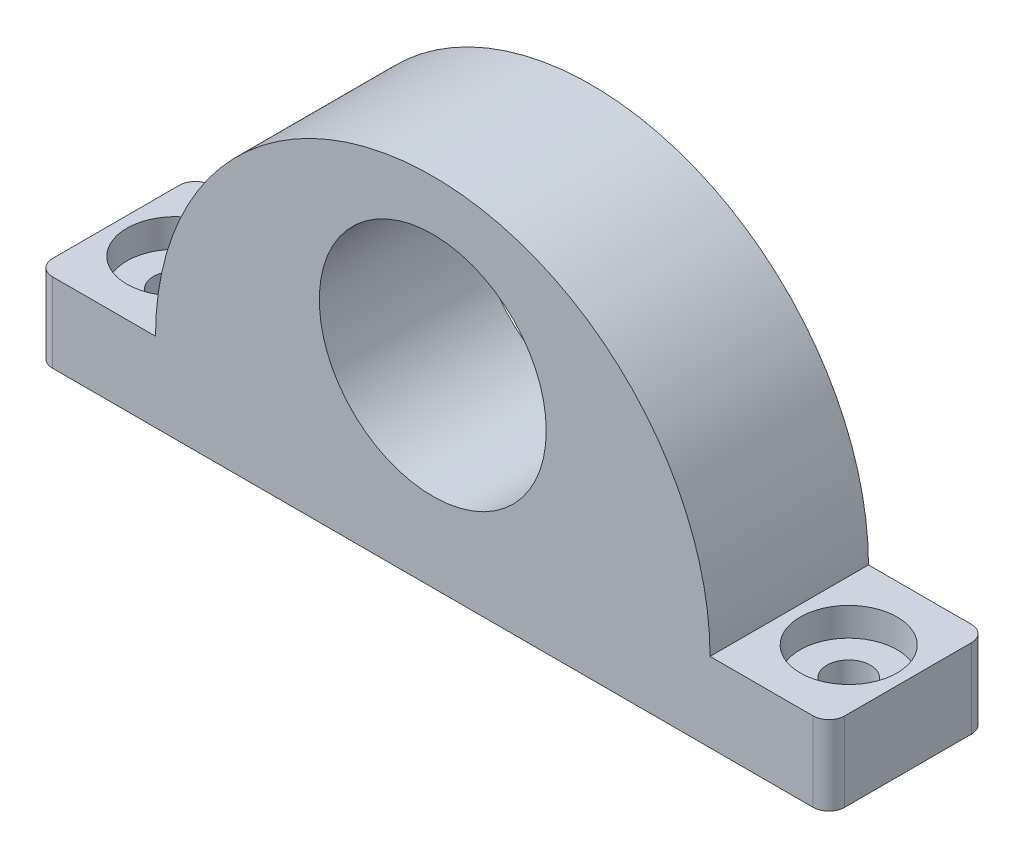
ISO-10303-21;
HEADER;
FILE_DESCRIPTION(('STEP AP214'),'2;1');
FILE_NAME('part.step','',(''),(''),'','','');
FILE_SCHEMA(('AUTOMOTIVE_DESIGN { 1 0 10303 214 1 1 1 1 }'));
ENDSEC;
DATA;
#1=APPLICATION_CONTEXT('core data for automotive mechanical design processes');
#2=APPLICATION_PROTOCOL_DEFINITION('international standard','automotive_design',2000,#1);
#3=PRODUCT_CONTEXT('',#1,'mechanical');
#4=PRODUCT('Part','Part','',(#3));
#5=PRODUCT_RELATED_PRODUCT_CATEGORY('part','',(#4));
#6=PRODUCT_DEFINITION_FORMATION('','',#4);
#7=PRODUCT_DEFINITION_CONTEXT('part definition',#1,'design');
#8=PRODUCT_DEFINITION('design','',#6,#7);
#9=PRODUCT_DEFINITION_SHAPE('','',#8);
#10=(LENGTH_UNIT() NAMED_UNIT(*) SI_UNIT(.MILLI.,.METRE.));
#11=(NAMED_UNIT(*) PLANE_ANGLE_UNIT() SI_UNIT($,.RADIAN.));
#12=(NAMED_UNIT(*) SI_UNIT($,.STERADIAN.) SOLID_ANGLE_UNIT());
#13=UNCERTAINTY_MEASURE_WITH_UNIT(LENGTH_MEASURE(1.E-05),#10,'distance_accuracy_value','');
#14=(GEOMETRIC_REPRESENTATION_CONTEXT(3) GLOBAL_UNCERTAINTY_ASSIGNED_CONTEXT((#13)) GLOBAL_UNIT_ASSIGNED_CONTEXT((#10,
#11,#12)) REPRESENTATION_CONTEXT('',''));
#15=CARTESIAN_POINT('',(0.,0.,0.));
#16=DIRECTION('',(0.,0.,1.));
#17=DIRECTION('',(1.,0.,0.));
#18=AXIS2_PLACEMENT_3D('',#15,#16,#17);
#19=CARTESIAN_POINT('',(-50.,0.,20.));
#20=DIRECTION('',(-1.,0.,0.));
#21=DIRECTION('',(0.,0.,1.));
#22=AXIS2_PLACEMENT_3D('',#19,#20,#21);
#23=PLANE('',#22);
#24=DIRECTION('',(0.,0.,-1.));
#25=VECTOR('',#24,1.);
#26=CARTESIAN_POINT('',(-50.,5.,20.));
#27=LINE('',#26,#25);
#28=CARTESIAN_POINT('',(-50.,5.,18.));
#29=VERTEX_POINT('',#28);
#30=CARTESIAN_POINT('',(-50.,5.,2.));
#31=VERTEX_POINT('',#30);
#32=EDGE_CURVE('E148',#29,#31,#27,.T.);
#33=ORIENTED_EDGE('',*,*,#32,.T.);
#34=DIRECTION('',(0.,1.,0.));
#35=VECTOR('',#34,1.);
#36=CARTESIAN_POINT('',(-50.,-5.,2.));
#37=LINE('',#36,#35);
#38=CARTESIAN_POINT('',(-50.,-5.,2.));
#39=VERTEX_POINT('',#38);
#40=EDGE_CURVE('E183',#31,#39,#37,.F.);
#41=ORIENTED_EDGE('',*,*,#40,.T.);
#42=DIRECTION('',(0.,0.,-1.));
#43=VECTOR('',#42,1.);
#44=CARTESIAN_POINT('',(-50.,-5.,20.));
#45=LINE('',#44,#43);
#46=CARTESIAN_POINT('',(-50.,-5.,18.));
#47=VERTEX_POINT('',#46);
#48=EDGE_CURVE('E168',#47,#39,#45,.T.);
#49=ORIENTED_EDGE('',*,*,#48,.F.);
#50=DIRECTION('',(0.,1.,0.));
#51=VECTOR('',#50,1.);
#52=CARTESIAN_POINT('',(-50.,0.,18.));
#53=LINE('',#52,#51);
#54=EDGE_CURVE('E180',#47,#29,#53,.T.);
#55=ORIENTED_EDGE('',*,*,#54,.T.);
#56=EDGE_LOOP('',(#33,#41,#49,#55));
#57=FACE_BOUND('',#56,.T.);
#58=ADVANCED_FACE('F34',(#57),#23,.T.);
#59=CARTESIAN_POINT('',(0.,-5.,20.));
#60=DIRECTION('',(0.,-1.,0.));
#61=DIRECTION('',(1.,0.,0.));
#62=AXIS2_PLACEMENT_3D('',#59,#60,#61);
#63=PLANE('',#62);
#64=CARTESIAN_POINT('',(-42.5,-5.,10.));
#65=DIRECTION('',(0.,-1.,0.));
#66=DIRECTION('',(1.,0.,0.));
#67=AXIS2_PLACEMENT_3D('',#64,#65,#66);
#68=CIRCLE('',#67,2.75);
#69=CARTESIAN_POINT('',(-39.75,-5.,10.));
#70=VERTEX_POINT('',#69);
#71=EDGE_CURVE('E419',#70,#70,#68,.T.);
#72=ORIENTED_EDGE('',*,*,#71,.F.);
#73=EDGE_LOOP('',(#72));
#74=FACE_BOUND('',#73,.T.);
#75=CARTESIAN_POINT('',(42.5,-4.99999999999999,10.));
#76=DIRECTION('',(0.,-1.,0.));
#77=DIRECTION('',(1.,0.,0.));
#78=AXIS2_PLACEMENT_3D('',#75,#76,#77);
#79=CIRCLE('',#78,2.75);
#80=CARTESIAN_POINT('',(45.25,-4.99999999999999,10.));
#81=VERTEX_POINT('',#80);
#82=EDGE_CURVE('E152',#81,#81,#79,.T.);
#83=ORIENTED_EDGE('',*,*,#82,.F.);
#84=EDGE_LOOP('',(#83));
#85=FACE_BOUND('',#84,.T.);
#86=ORIENTED_EDGE('',*,*,#48,.T.);
#87=CARTESIAN_POINT('',(-48.,-5.,2.));
#88=DIRECTION('',(0.,-1.,0.));
#89=DIRECTION('',(1.,0.,0.));
#90=AXIS2_PLACEMENT_3D('',#87,#88,#89);
#91=CIRCLE('',#90,2.);
#92=CARTESIAN_POINT('',(-48.,-5.,0.));
#93=VERTEX_POINT('',#92);
#94=EDGE_CURVE('E191',#39,#93,#91,.T.);
#95=ORIENTED_EDGE('',*,*,#94,.T.);
#96=DIRECTION('',(-1.,0.,0.));
#97=VECTOR('',#96,1.);
#98=CARTESIAN_POINT('',(0.,-5.,0.));
#99=LINE('',#98,#97);
#100=CARTESIAN_POINT('',(48.,-4.99999999999999,0.));
#101=VERTEX_POINT('',#100);
#102=EDGE_CURVE('E149',#101,#93,#99,.T.);
#103=ORIENTED_EDGE('',*,*,#102,.F.);
#104=CARTESIAN_POINT('',(48.,-4.99999999999999,2.));
#105=DIRECTION('',(0.,-1.,0.));
#106=DIRECTION('',(1.,0.,0.));
#107=AXIS2_PLACEMENT_3D('',#104,#105,#106);
#108=CIRCLE('',#107,2.);
#109=CARTESIAN_POINT('',(50.,-4.99999999999997,2.));
#110=VERTEX_POINT('',#109);
#111=EDGE_CURVE('E189',#101,#110,#108,.T.);
#112=ORIENTED_EDGE('',*,*,#111,.T.);
#113=DIRECTION('',(0.,0.,-1.));
#114=VECTOR('',#113,1.);
#115=CARTESIAN_POINT('',(50.,-4.99999999999997,20.));
#116=LINE('',#115,#114);
#117=CARTESIAN_POINT('',(50.,-4.99999999999997,18.));
#118=VERTEX_POINT('',#117);
#119=EDGE_CURVE('E165',#118,#110,#116,.T.);
#120=ORIENTED_EDGE('',*,*,#119,.F.);
#121=CARTESIAN_POINT('',(48.,-4.99999999999999,18.));
#122=DIRECTION('',(0.,-1.,0.));
#123=DIRECTION('',(1.,0.,0.));
#124=AXIS2_PLACEMENT_3D('',#121,#122,#123);
#125=CIRCLE('',#124,2.);
#126=CARTESIAN_POINT('',(48.,-4.99999999999999,20.));
#127=VERTEX_POINT('',#126);
#128=EDGE_CURVE('E187',#118,#127,#125,.T.);
#129=ORIENTED_EDGE('',*,*,#128,.T.);
#130=DIRECTION('',(-1.,0.,0.));
#131=VECTOR('',#130,1.);
#132=CARTESIAN_POINT('',(0.,-5.,20.));
#133=LINE('',#132,#131);
#134=CARTESIAN_POINT('',(-48.,-5.,20.));
#135=VERTEX_POINT('',#134);
#136=EDGE_CURVE('E137',#127,#135,#133,.T.);
#137=ORIENTED_EDGE('',*,*,#136,.T.);
#138=CARTESIAN_POINT('',(-48.,-5.,18.));
#139=DIRECTION('',(0.,-1.,0.));
#140=DIRECTION('',(1.,0.,0.));
#141=AXIS2_PLACEMENT_3D('',#138,#139,#140);
#142=CIRCLE('',#141,2.);
#143=EDGE_CURVE('E185',#135,#47,#142,.T.);
#144=ORIENTED_EDGE('',*,*,#143,.T.);
#145=EDGE_LOOP('',(#86,#95,#103,#112,#120,#129,#137,#144));
#146=FACE_BOUND('',#145,.T.);
#147=ADVANCED_FACE('F202',(#74,#85,#146),#63,.T.);
#148=CARTESIAN_POINT('',(50.,0.,20.));
#149=DIRECTION('',(-1.,0.,0.));
#150=DIRECTION('',(0.,0.,1.));
#151=AXIS2_PLACEMENT_3D('',#148,#149,#150);
#152=PLANE('',#151);
#153=ORIENTED_EDGE('',*,*,#119,.T.);
#154=DIRECTION('',(0.,1.,0.));
#155=VECTOR('',#154,1.);
#156=CARTESIAN_POINT('',(50.,0.,2.));
#157=LINE('',#156,#155);
#158=CARTESIAN_POINT('',(50.,5.00000000000003,2.));
#159=VERTEX_POINT('',#158);
#160=EDGE_CURVE('E195',#110,#159,#157,.T.);
#161=ORIENTED_EDGE('',*,*,#160,.T.);
#162=DIRECTION('',(0.,0.,-1.));
#163=VECTOR('',#162,1.);
#164=CARTESIAN_POINT('',(50.,5.00000000000003,20.));
#165=LINE('',#164,#163);
#166=CARTESIAN_POINT('',(50.,5.00000000000003,18.));
#167=VERTEX_POINT('',#166);
#168=EDGE_CURVE('E122',#167,#159,#165,.T.);
#169=ORIENTED_EDGE('',*,*,#168,.F.);
#170=DIRECTION('',(0.,1.,0.));
#171=VECTOR('',#170,1.);
#172=CARTESIAN_POINT('',(50.,-4.99999999999997,18.));
#173=LINE('',#172,#171);
#174=EDGE_CURVE('E193',#167,#118,#173,.F.);
#175=ORIENTED_EDGE('',*,*,#174,.T.);
#176=EDGE_LOOP('',(#153,#161,#169,#175));
#177=FACE_BOUND('',#176,.T.);
#178=ADVANCED_FACE('F225',(#177),#152,.F.);
#179=CARTESIAN_POINT('',(0.,4.99999999999992,20.));
#180=DIRECTION('',(0.,1.,0.));
#181=DIRECTION('',(-1.,0.,0.));
#182=AXIS2_PLACEMENT_3D('',#179,#180,#181);
#183=PLANE('',#182);
#184=CARTESIAN_POINT('',(42.5,5.00000000000001,10.));
#185=DIRECTION('',(0.,1.,0.));
#186=DIRECTION('',(0.,0.,1.));
#187=AXIS2_PLACEMENT_3D('',#184,#185,#186);
#188=CIRCLE('',#187,6.12);
#189=CARTESIAN_POINT('',(42.5,5.00000000000001,16.12));
#190=VERTEX_POINT('',#189);
#191=EDGE_CURVE('E416',#190,#190,#188,.T.);
#192=ORIENTED_EDGE('',*,*,#191,.F.);
#193=EDGE_LOOP('',(#192));
#194=FACE_BOUND('',#193,.T.);
#195=ORIENTED_EDGE('',*,*,#168,.T.);
#196=CARTESIAN_POINT('',(48.,5.00000000000003,2.));
#197=DIRECTION('',(0.,1.,0.));
#198=DIRECTION('',(-1.,0.,0.));
#199=AXIS2_PLACEMENT_3D('',#196,#197,#198);
#200=CIRCLE('',#199,2.);
#201=CARTESIAN_POINT('',(48.,5.00000000000003,0.));
#202=VERTEX_POINT('',#201);
#203=EDGE_CURVE('E56',#159,#202,#200,.T.);
#204=ORIENTED_EDGE('',*,*,#203,.T.);
#205=DIRECTION('',(1.,0.,0.));
#206=VECTOR('',#205,1.);
#207=CARTESIAN_POINT('',(0.,4.99999999999992,0.));
#208=LINE('',#207,#206);
#209=CARTESIAN_POINT('',(35.,5.,0.));
#210=VERTEX_POINT('',#209);
#211=EDGE_CURVE('E119',#210,#202,#208,.T.);
#212=ORIENTED_EDGE('',*,*,#211,.F.);
#213=DIRECTION('',(0.,0.,-1.));
#214=VECTOR('',#213,1.);
#215=CARTESIAN_POINT('',(35.,5.,20.));
#216=LINE('',#215,#214);
#217=CARTESIAN_POINT('',(35.,5.,20.));
#218=VERTEX_POINT('',#217);
#219=EDGE_CURVE('E112',#218,#210,#216,.T.);
#220=ORIENTED_EDGE('',*,*,#219,.F.);
#221=DIRECTION('',(1.,0.,0.));
#222=VECTOR('',#221,1.);
#223=CARTESIAN_POINT('',(0.,4.99999999999992,20.));
#224=LINE('',#223,#222);
#225=CARTESIAN_POINT('',(48.,5.00000000000003,20.));
#226=VERTEX_POINT('',#225);
#227=EDGE_CURVE('E117',#218,#226,#224,.T.);
#228=ORIENTED_EDGE('',*,*,#227,.T.);
#229=CARTESIAN_POINT('',(48.,5.00000000000003,18.));
#230=DIRECTION('',(0.,1.,0.));
#231=DIRECTION('',(-1.,0.,0.));
#232=AXIS2_PLACEMENT_3D('',#229,#230,#231);
#233=CIRCLE('',#232,2.);
#234=EDGE_CURVE('E49',#226,#167,#233,.T.);
#235=ORIENTED_EDGE('',*,*,#234,.T.);
#236=EDGE_LOOP('',(#195,#204,#212,#220,#228,#235));
#237=FACE_BOUND('',#236,.T.);
#238=ADVANCED_FACE('F115',(#194,#237),#183,.T.);
#239=CARTESIAN_POINT('',(0.,5.,20.));
#240=DIRECTION('',(0.,0.,-1.));
#241=DIRECTION('',(-1.,0.,0.));
#242=AXIS2_PLACEMENT_3D('',#239,#240,#241);
#243=CYLINDRICAL_SURFACE('',#242,35.);
#244=CARTESIAN_POINT('',(0.,5.,0.));
#245=DIRECTION('',(0.,0.,1.));
#246=DIRECTION('',(1.,0.,0.));
#247=AXIS2_PLACEMENT_3D('',#244,#245,#246);
#248=CIRCLE('',#247,35.);
#249=CARTESIAN_POINT('',(-35.,5.,0.));
#250=VERTEX_POINT('',#249);
#251=EDGE_CURVE('E154',#210,#250,#248,.T.);
#252=ORIENTED_EDGE('',*,*,#251,.T.);
#253=DIRECTION('',(0.,0.,-1.));
#254=VECTOR('',#253,1.);
#255=CARTESIAN_POINT('',(-35.,5.,20.));
#256=LINE('',#255,#254);
#257=CARTESIAN_POINT('',(-35.,5.,20.));
#258=VERTEX_POINT('',#257);
#259=EDGE_CURVE('E123',#258,#250,#256,.T.);
#260=ORIENTED_EDGE('',*,*,#259,.F.);
#261=CARTESIAN_POINT('',(0.,5.,20.));
#262=DIRECTION('',(0.,0.,1.));
#263=DIRECTION('',(1.,0.,0.));
#264=AXIS2_PLACEMENT_3D('',#261,#262,#263);
#265=CIRCLE('',#264,35.);
#266=EDGE_CURVE('E126',#218,#258,#265,.T.);
#267=ORIENTED_EDGE('',*,*,#266,.F.);
#268=ORIENTED_EDGE('',*,*,#219,.T.);
#269=EDGE_LOOP('',(#252,#260,#267,#268));
#270=FACE_BOUND('',#269,.T.);
#271=ADVANCED_FACE('F127',(#270),#243,.T.);
#272=CARTESIAN_POINT('',(0.,5.,20.));
#273=DIRECTION('',(0.,-1.,0.));
#274=DIRECTION('',(1.,0.,0.));
#275=AXIS2_PLACEMENT_3D('',#272,#273,#274);
#276=PLANE('',#275);
#277=CARTESIAN_POINT('',(-42.5,5.,10.));
#278=DIRECTION('',(0.,1.,0.));
#279=DIRECTION('',(0.,0.,1.));
#280=AXIS2_PLACEMENT_3D('',#277,#278,#279);
#281=CIRCLE('',#280,6.12);
#282=CARTESIAN_POINT('',(-42.5,5.,16.12));
#283=VERTEX_POINT('',#282);
#284=EDGE_CURVE('E442',#283,#283,#281,.T.);
#285=ORIENTED_EDGE('',*,*,#284,.F.);
#286=EDGE_LOOP('',(#285));
#287=FACE_BOUND('',#286,.T.);
#288=DIRECTION('',(-1.,0.,0.));
#289=VECTOR('',#288,1.);
#290=CARTESIAN_POINT('',(0.,5.,0.));
#291=LINE('',#290,#289);
#292=CARTESIAN_POINT('',(-48.,5.,0.));
#293=VERTEX_POINT('',#292);
#294=EDGE_CURVE('E156',#250,#293,#291,.T.);
#295=ORIENTED_EDGE('',*,*,#294,.T.);
#296=CARTESIAN_POINT('',(-48.,5.,2.));
#297=DIRECTION('',(0.,-1.,0.));
#298=DIRECTION('',(1.,0.,0.));
#299=AXIS2_PLACEMENT_3D('',#296,#297,#298);
#300=CIRCLE('',#299,2.);
#301=EDGE_CURVE('E178',#293,#31,#300,.F.);
#302=ORIENTED_EDGE('',*,*,#301,.T.);
#303=ORIENTED_EDGE('',*,*,#32,.F.);
#304=CARTESIAN_POINT('',(-48.,5.,18.));
#305=DIRECTION('',(0.,-1.,0.));
#306=DIRECTION('',(1.,0.,0.));
#307=AXIS2_PLACEMENT_3D('',#304,#305,#306);
#308=CIRCLE('',#307,2.);
#309=CARTESIAN_POINT('',(-48.,5.,20.));
#310=VERTEX_POINT('',#309);
#311=EDGE_CURVE('E176',#29,#310,#308,.F.);
#312=ORIENTED_EDGE('',*,*,#311,.T.);
#313=DIRECTION('',(-1.,0.,0.));
#314=VECTOR('',#313,1.);
#315=CARTESIAN_POINT('',(0.,5.,20.));
#316=LINE('',#315,#314);
#317=EDGE_CURVE('E132',#258,#310,#316,.T.);
#318=ORIENTED_EDGE('',*,*,#317,.F.);
#319=ORIENTED_EDGE('',*,*,#259,.T.);
#320=EDGE_LOOP('',(#295,#302,#303,#312,#318,#319));
#321=FACE_BOUND('',#320,.T.);
#322=ADVANCED_FACE('F211',(#287,#321),#276,.F.);
#323=CARTESIAN_POINT('',(0.,19.325,20.));
#324=DIRECTION('',(0.,0.,-1.));
#325=DIRECTION('',(-1.,0.,0.));
#326=AXIS2_PLACEMENT_3D('',#323,#324,#325);
#327=CYLINDRICAL_SURFACE('',#326,14.325);
#328=CARTESIAN_POINT('',(0.,19.325,20.));
#329=DIRECTION('',(0.,0.,1.));
#330=DIRECTION('',(1.,0.,0.));
#331=AXIS2_PLACEMENT_3D('',#328,#329,#330);
#332=CIRCLE('',#331,14.325);
#333=CARTESIAN_POINT('',(14.325,19.325,20.));
#334=VERTEX_POINT('',#333);
#335=EDGE_CURVE('E145',#334,#334,#332,.T.);
#336=ORIENTED_EDGE('',*,*,#335,.T.);
#337=EDGE_LOOP('',(#336));
#338=FACE_BOUND('',#337,.T.);
#339=CARTESIAN_POINT('',(0.,19.325,0.));
#340=DIRECTION('',(0.,0.,1.));
#341=DIRECTION('',(1.,0.,0.));
#342=AXIS2_PLACEMENT_3D('',#339,#340,#341);
#343=CIRCLE('',#342,14.325);
#344=CARTESIAN_POINT('',(14.325,19.325,0.));
#345=VERTEX_POINT('',#344);
#346=EDGE_CURVE('E140',#345,#345,#343,.T.);
#347=ORIENTED_EDGE('',*,*,#346,.F.);
#348=EDGE_LOOP('',(#347));
#349=FACE_BOUND('',#348,.T.);
#350=ADVANCED_FACE('F276',(#338,#349),#327,.F.);
#351=CARTESIAN_POINT('',(0.,0.,20.));
#352=DIRECTION('',(0.,0.,1.));
#353=DIRECTION('',(1.,0.,0.));
#354=AXIS2_PLACEMENT_3D('',#351,#352,#353);
#355=PLANE('',#354);
#356=ORIENTED_EDGE('',*,*,#136,.F.);
#357=DIRECTION('',(0.,1.,0.));
#358=VECTOR('',#357,1.);
#359=CARTESIAN_POINT('',(48.,5.00000000000003,20.));
#360=LINE('',#359,#358);
#361=EDGE_CURVE('E11',#127,#226,#360,.T.);
#362=ORIENTED_EDGE('',*,*,#361,.T.);
#363=ORIENTED_EDGE('',*,*,#227,.F.);
#364=ORIENTED_EDGE('',*,*,#266,.T.);
#365=ORIENTED_EDGE('',*,*,#317,.T.);
#366=DIRECTION('',(0.,1.,0.));
#367=VECTOR('',#366,1.);
#368=CARTESIAN_POINT('',(-48.,0.,20.));
#369=LINE('',#368,#367);
#370=EDGE_CURVE('E42',#310,#135,#369,.F.);
#371=ORIENTED_EDGE('',*,*,#370,.T.);
#372=EDGE_LOOP('',(#356,#362,#363,#364,#365,#371));
#373=FACE_BOUND('',#372,.T.);
#374=ORIENTED_EDGE('',*,*,#335,.F.);
#375=EDGE_LOOP('',(#374));
#376=FACE_BOUND('',#375,.T.);
#377=ADVANCED_FACE('F135',(#373,#376),#355,.T.);
#378=CARTESIAN_POINT('',(0.,0.,0.));
#379=DIRECTION('',(0.,0.,1.));
#380=DIRECTION('',(1.,0.,0.));
#381=AXIS2_PLACEMENT_3D('',#378,#379,#380);
#382=PLANE('',#381);
#383=ORIENTED_EDGE('',*,*,#102,.T.);
#384=DIRECTION('',(0.,1.,0.));
#385=VECTOR('',#384,1.);
#386=CARTESIAN_POINT('',(-48.,5.,0.));
#387=LINE('',#386,#385);
#388=EDGE_CURVE('E173',#93,#293,#387,.T.);
#389=ORIENTED_EDGE('',*,*,#388,.T.);
#390=ORIENTED_EDGE('',*,*,#294,.F.);
#391=ORIENTED_EDGE('',*,*,#251,.F.);
#392=ORIENTED_EDGE('',*,*,#211,.T.);
#393=DIRECTION('',(0.,1.,0.));
#394=VECTOR('',#393,1.);
#395=CARTESIAN_POINT('',(48.,0.,0.));
#396=LINE('',#395,#394);
#397=EDGE_CURVE('E171',#202,#101,#396,.F.);
#398=ORIENTED_EDGE('',*,*,#397,.T.);
#399=EDGE_LOOP('',(#383,#389,#390,#391,#392,#398));
#400=FACE_BOUND('',#399,.T.);
#401=ORIENTED_EDGE('',*,*,#346,.T.);
#402=EDGE_LOOP('',(#401));
#403=FACE_BOUND('',#402,.T.);
#404=ADVANCED_FACE('F218',(#400,#403),#382,.F.);
#405=CARTESIAN_POINT('',(42.5,5.00000000000001,10.));
#406=DIRECTION('',(0.,1.,0.));
#407=DIRECTION('',(0.,0.,1.));
#408=AXIS2_PLACEMENT_3D('',#405,#406,#407);
#409=CYLINDRICAL_SURFACE('',#408,2.75);
#410=CARTESIAN_POINT('',(42.5,1.42000000000001,10.));
#411=DIRECTION('',(0.,1.,0.));
#412=DIRECTION('',(0.,0.,1.));
#413=AXIS2_PLACEMENT_3D('',#410,#411,#412);
#414=CIRCLE('',#413,2.75000000000001);
#415=CARTESIAN_POINT('',(42.5,1.42000000000001,12.75));
#416=VERTEX_POINT('',#415);
#417=EDGE_CURVE('E422',#416,#416,#414,.T.);
#418=ORIENTED_EDGE('',*,*,#417,.T.);
#419=EDGE_LOOP('',(#418));
#420=FACE_BOUND('',#419,.T.);
#421=ORIENTED_EDGE('',*,*,#82,.T.);
#422=EDGE_LOOP('',(#421));
#423=FACE_BOUND('',#422,.T.);
#424=ADVANCED_FACE('F269',(#420,#423),#409,.F.);
#425=CARTESIAN_POINT('',(45.25,1.42000000000001,10.));
#426=DIRECTION('',(0.,-1.,0.));
#427=DIRECTION('',(0.,0.,-1.));
#428=AXIS2_PLACEMENT_3D('',#425,#426,#427);
#429=PLANE('',#428);
#430=ORIENTED_EDGE('',*,*,#417,.F.);
#431=EDGE_LOOP('',(#430));
#432=FACE_BOUND('',#431,.T.);
#433=CARTESIAN_POINT('',(42.5,1.42000000000001,10.));
#434=DIRECTION('',(0.,1.,0.));
#435=DIRECTION('',(0.,0.,1.));
#436=AXIS2_PLACEMENT_3D('',#433,#434,#435);
#437=CIRCLE('',#436,6.12);
#438=CARTESIAN_POINT('',(42.5,1.42000000000001,16.12));
#439=VERTEX_POINT('',#438);
#440=EDGE_CURVE('E418',#439,#439,#437,.T.);
#441=ORIENTED_EDGE('',*,*,#440,.T.);
#442=EDGE_LOOP('',(#441));
#443=FACE_BOUND('',#442,.T.);
#444=ADVANCED_FACE('F265',(#432,#443),#429,.F.);
#445=CARTESIAN_POINT('',(42.5,5.00000000000001,10.));
#446=DIRECTION('',(0.,1.,0.));
#447=DIRECTION('',(0.,0.,1.));
#448=AXIS2_PLACEMENT_3D('',#445,#446,#447);
#449=CYLINDRICAL_SURFACE('',#448,6.12);
#450=ORIENTED_EDGE('',*,*,#440,.F.);
#451=EDGE_LOOP('',(#450));
#452=FACE_BOUND('',#451,.T.);
#453=ORIENTED_EDGE('',*,*,#191,.T.);
#454=EDGE_LOOP('',(#453));
#455=FACE_BOUND('',#454,.T.);
#456=ADVANCED_FACE('F261',(#452,#455),#449,.F.);
#457=CARTESIAN_POINT('',(-42.5,5.,10.));
#458=DIRECTION('',(0.,1.,0.));
#459=DIRECTION('',(0.,0.,1.));
#460=AXIS2_PLACEMENT_3D('',#457,#458,#459);
#461=CYLINDRICAL_SURFACE('',#460,2.75);
#462=CARTESIAN_POINT('',(-42.5,1.42,10.));
#463=DIRECTION('',(0.,1.,0.));
#464=DIRECTION('',(0.,0.,1.));
#465=AXIS2_PLACEMENT_3D('',#462,#463,#464);
#466=CIRCLE('',#465,2.75000000000001);
#467=CARTESIAN_POINT('',(-42.5,1.42,12.75));
#468=VERTEX_POINT('',#467);
#469=EDGE_CURVE('E425',#468,#468,#466,.T.);
#470=ORIENTED_EDGE('',*,*,#469,.T.);
#471=EDGE_LOOP('',(#470));
#472=FACE_BOUND('',#471,.T.);
#473=ORIENTED_EDGE('',*,*,#71,.T.);
#474=EDGE_LOOP('',(#473));
#475=FACE_BOUND('',#474,.T.);
#476=ADVANCED_FACE('F253',(#472,#475),#461,.F.);
#477=CARTESIAN_POINT('',(-39.75,1.42,10.));
#478=DIRECTION('',(0.,-1.,0.));
#479=DIRECTION('',(0.,0.,-1.));
#480=AXIS2_PLACEMENT_3D('',#477,#478,#479);
#481=PLANE('',#480);
#482=ORIENTED_EDGE('',*,*,#469,.F.);
#483=EDGE_LOOP('',(#482));
#484=FACE_BOUND('',#483,.T.);
#485=CARTESIAN_POINT('',(-42.5,1.42,10.));
#486=DIRECTION('',(0.,1.,0.));
#487=DIRECTION('',(0.,0.,1.));
#488=AXIS2_PLACEMENT_3D('',#485,#486,#487);
#489=CIRCLE('',#488,6.12);
#490=CARTESIAN_POINT('',(-42.5,1.42,16.12));
#491=VERTEX_POINT('',#490);
#492=EDGE_CURVE('E439',#491,#491,#489,.T.);
#493=ORIENTED_EDGE('',*,*,#492,.T.);
#494=EDGE_LOOP('',(#493));
#495=FACE_BOUND('',#494,.T.);
#496=ADVANCED_FACE('F248',(#484,#495),#481,.F.);
#497=CARTESIAN_POINT('',(-42.5,5.,10.));
#498=DIRECTION('',(0.,1.,0.));
#499=DIRECTION('',(0.,0.,1.));
#500=AXIS2_PLACEMENT_3D('',#497,#498,#499);
#501=CYLINDRICAL_SURFACE('',#500,6.12);
#502=ORIENTED_EDGE('',*,*,#492,.F.);
#503=EDGE_LOOP('',(#502));
#504=FACE_BOUND('',#503,.T.);
#505=ORIENTED_EDGE('',*,*,#284,.T.);
#506=EDGE_LOOP('',(#505));
#507=FACE_BOUND('',#506,.T.);
#508=ADVANCED_FACE('F244',(#504,#507),#501,.F.);
#509=CARTESIAN_POINT('',(-48.,0.,2.));
#510=DIRECTION('',(0.,-1.,0.));
#511=DIRECTION('',(0.,0.,-1.));
#512=AXIS2_PLACEMENT_3D('',#509,#510,#511);
#513=CYLINDRICAL_SURFACE('',#512,2.);
#514=ORIENTED_EDGE('',*,*,#94,.F.);
#515=ORIENTED_EDGE('',*,*,#40,.F.);
#516=ORIENTED_EDGE('',*,*,#301,.F.);
#517=ORIENTED_EDGE('',*,*,#388,.F.);
#518=EDGE_LOOP('',(#514,#515,#516,#517));
#519=FACE_BOUND('',#518,.T.);
#520=ADVANCED_FACE('F216',(#519),#513,.T.);
#521=CARTESIAN_POINT('',(48.,0.,2.));
#522=DIRECTION('',(0.,1.,0.));
#523=DIRECTION('',(0.,0.,1.));
#524=AXIS2_PLACEMENT_3D('',#521,#522,#523);
#525=CYLINDRICAL_SURFACE('',#524,2.);
#526=ORIENTED_EDGE('',*,*,#111,.F.);
#527=ORIENTED_EDGE('',*,*,#397,.F.);
#528=ORIENTED_EDGE('',*,*,#203,.F.);
#529=ORIENTED_EDGE('',*,*,#160,.F.);
#530=EDGE_LOOP('',(#526,#527,#528,#529));
#531=FACE_BOUND('',#530,.T.);
#532=ADVANCED_FACE('F222',(#531),#525,.T.);
#533=CARTESIAN_POINT('',(48.,0.,18.));
#534=DIRECTION('',(0.,-1.,0.));
#535=DIRECTION('',(0.,0.,-1.));
#536=AXIS2_PLACEMENT_3D('',#533,#534,#535);
#537=CYLINDRICAL_SURFACE('',#536,2.);
#538=ORIENTED_EDGE('',*,*,#128,.F.);
#539=ORIENTED_EDGE('',*,*,#174,.F.);
#540=ORIENTED_EDGE('',*,*,#234,.F.);
#541=ORIENTED_EDGE('',*,*,#361,.F.);
#542=EDGE_LOOP('',(#538,#539,#540,#541));
#543=FACE_BOUND('',#542,.T.);
#544=ADVANCED_FACE('F226',(#543),#537,.T.);
#545=CARTESIAN_POINT('',(-48.,0.,18.));
#546=DIRECTION('',(0.,1.,0.));
#547=DIRECTION('',(0.,0.,1.));
#548=AXIS2_PLACEMENT_3D('',#545,#546,#547);
#549=CYLINDRICAL_SURFACE('',#548,2.);
#550=ORIENTED_EDGE('',*,*,#143,.F.);
#551=ORIENTED_EDGE('',*,*,#370,.F.);
#552=ORIENTED_EDGE('',*,*,#311,.F.);
#553=ORIENTED_EDGE('',*,*,#54,.F.);
#554=EDGE_LOOP('',(#550,#551,#552,#553));
#555=FACE_BOUND('',#554,.T.);
#556=ADVANCED_FACE('F36',(#555),#549,.T.);
#557=CLOSED_SHELL('',(#58,#147,#178,#238,#271,#322,#350,#377,#404,#424,#444,#456,#476,#496,#508,
#520,#532,#544,#556));
#558=MANIFOLD_SOLID_BREP('B2',#557);
#559=ADVANCED_BREP_SHAPE_REPRESENTATION('',(#18,#558),#14);
#560=SHAPE_DEFINITION_REPRESENTATION(#9,#559);
ENDSEC;
END-ISO-10303-21;
